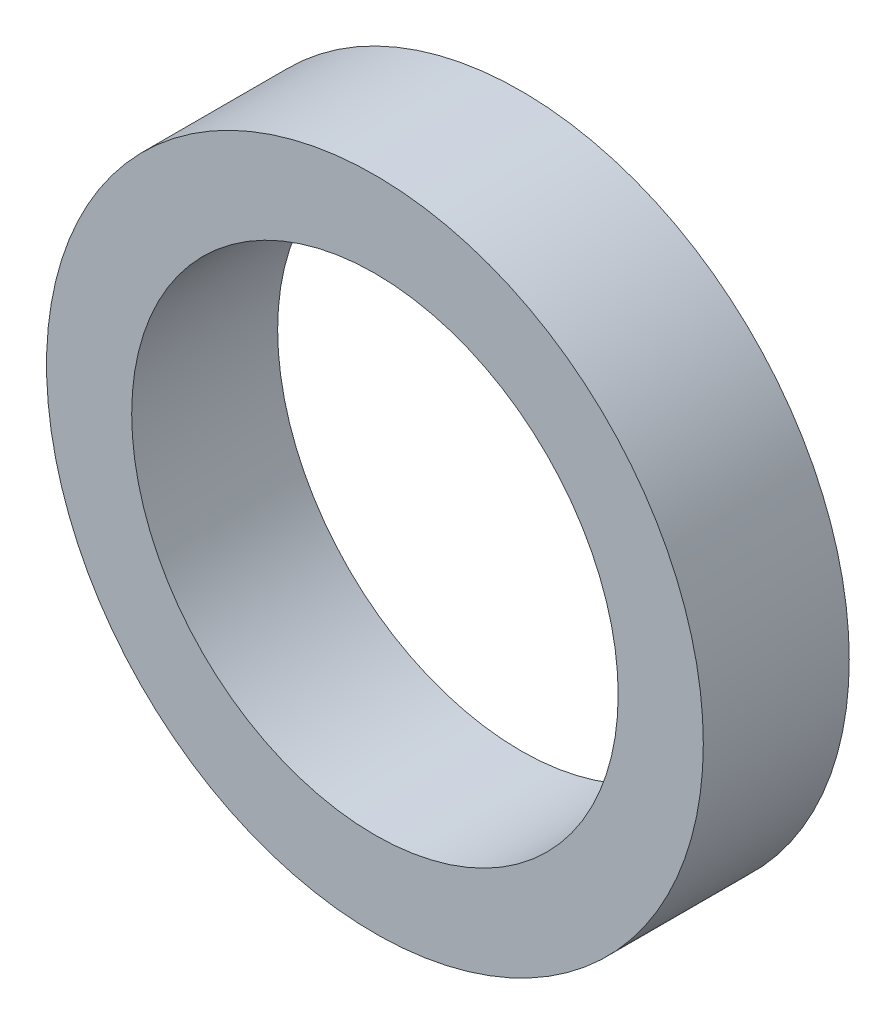
ISO-10303-21;
HEADER;
FILE_DESCRIPTION(('STEP AP214'),'2;1');
FILE_NAME('part.step','',(''),(''),'','','');
FILE_SCHEMA(('AUTOMOTIVE_DESIGN { 1 0 10303 214 1 1 1 1 }'));
ENDSEC;
DATA;
#1=APPLICATION_CONTEXT('core data for automotive mechanical design processes');
#2=APPLICATION_PROTOCOL_DEFINITION('international standard','automotive_design',2000,#1);
#3=PRODUCT_CONTEXT('',#1,'mechanical');
#4=PRODUCT('Part','Part','',(#3));
#5=PRODUCT_RELATED_PRODUCT_CATEGORY('part','',(#4));
#6=PRODUCT_DEFINITION_FORMATION('','',#4);
#7=PRODUCT_DEFINITION_CONTEXT('part definition',#1,'design');
#8=PRODUCT_DEFINITION('design','',#6,#7);
#9=PRODUCT_DEFINITION_SHAPE('','',#8);
#10=(LENGTH_UNIT() NAMED_UNIT(*) SI_UNIT(.MILLI.,.METRE.));
#11=(NAMED_UNIT(*) PLANE_ANGLE_UNIT() SI_UNIT($,.RADIAN.));
#12=(NAMED_UNIT(*) SI_UNIT($,.STERADIAN.) SOLID_ANGLE_UNIT());
#13=UNCERTAINTY_MEASURE_WITH_UNIT(LENGTH_MEASURE(1.E-05),#10,'distance_accuracy_value','');
#14=(GEOMETRIC_REPRESENTATION_CONTEXT(3) GLOBAL_UNCERTAINTY_ASSIGNED_CONTEXT((#13)) GLOBAL_UNIT_ASSIGNED_CONTEXT((#10,
#11,#12)) REPRESENTATION_CONTEXT('',''));
#15=CARTESIAN_POINT('',(0.,0.,0.));
#16=DIRECTION('',(0.,0.,1.));
#17=DIRECTION('',(1.,0.,0.));
#18=AXIS2_PLACEMENT_3D('',#15,#16,#17);
#19=CARTESIAN_POINT('',(0.,0.,6.));
#20=DIRECTION('',(0.,0.,-1.));
#21=DIRECTION('',(-1.,0.,0.));
#22=AXIS2_PLACEMENT_3D('',#19,#20,#21);
#23=CYLINDRICAL_SURFACE('',#22,13.5);
#24=CARTESIAN_POINT('',(0.,0.,6.));
#25=DIRECTION('',(0.,0.,1.));
#26=DIRECTION('',(1.,0.,0.));
#27=AXIS2_PLACEMENT_3D('',#24,#25,#26);
#28=CIRCLE('',#27,13.5);
#29=CARTESIAN_POINT('',(13.5,0.,6.));
#30=VERTEX_POINT('',#29);
#31=EDGE_CURVE('E10',#30,#30,#28,.T.);
#32=ORIENTED_EDGE('',*,*,#31,.F.);
#33=EDGE_LOOP('',(#32));
#34=FACE_BOUND('',#33,.T.);
#35=CARTESIAN_POINT('',(0.,0.,0.));
#36=DIRECTION('',(0.,0.,1.));
#37=DIRECTION('',(1.,0.,0.));
#38=AXIS2_PLACEMENT_3D('',#35,#36,#37);
#39=CIRCLE('',#38,13.5);
#40=CARTESIAN_POINT('',(13.5,0.,0.));
#41=VERTEX_POINT('',#40);
#42=EDGE_CURVE('E34',#41,#41,#39,.T.);
#43=ORIENTED_EDGE('',*,*,#42,.T.);
#44=EDGE_LOOP('',(#43));
#45=FACE_BOUND('',#44,.T.);
#46=ADVANCED_FACE('F31',(#34,#45),#23,.T.);
#47=CARTESIAN_POINT('',(0.,0.,6.));
#48=DIRECTION('',(0.,0.,1.));
#49=DIRECTION('',(1.,0.,0.));
#50=AXIS2_PLACEMENT_3D('',#47,#48,#49);
#51=PLANE('',#50);
#52=CARTESIAN_POINT('',(0.,0.,6.));
#53=DIRECTION('',(0.,0.,-1.));
#54=DIRECTION('',(-1.,0.,0.));
#55=AXIS2_PLACEMENT_3D('',#52,#53,#54);
#56=CIRCLE('',#55,10.);
#57=CARTESIAN_POINT('',(-10.,0.,6.));
#58=VERTEX_POINT('',#57);
#59=EDGE_CURVE('E41',#58,#58,#56,.T.);
#60=ORIENTED_EDGE('',*,*,#59,.T.);
#61=EDGE_LOOP('',(#60));
#62=FACE_BOUND('',#61,.T.);
#63=ORIENTED_EDGE('',*,*,#31,.T.);
#64=EDGE_LOOP('',(#63));
#65=FACE_BOUND('',#64,.T.);
#66=ADVANCED_FACE('F49',(#62,#65),#51,.T.);
#67=CARTESIAN_POINT('',(0.,0.,0.));
#68=DIRECTION('',(0.,0.,1.));
#69=DIRECTION('',(1.,0.,0.));
#70=AXIS2_PLACEMENT_3D('',#67,#68,#69);
#71=PLANE('',#70);
#72=CARTESIAN_POINT('',(0.,0.,0.));
#73=DIRECTION('',(0.,0.,-1.));
#74=DIRECTION('',(-1.,0.,0.));
#75=AXIS2_PLACEMENT_3D('',#72,#73,#74);
#76=CIRCLE('',#75,10.);
#77=CARTESIAN_POINT('',(-10.,0.,0.));
#78=VERTEX_POINT('',#77);
#79=EDGE_CURVE('E43',#78,#78,#76,.T.);
#80=ORIENTED_EDGE('',*,*,#79,.F.);
#81=EDGE_LOOP('',(#80));
#82=FACE_BOUND('',#81,.T.);
#83=ORIENTED_EDGE('',*,*,#42,.F.);
#84=EDGE_LOOP('',(#83));
#85=FACE_BOUND('',#84,.T.);
#86=ADVANCED_FACE('F54',(#82,#85),#71,.F.);
#87=CARTESIAN_POINT('',(0.,0.,6.));
#88=DIRECTION('',(0.,0.,-1.));
#89=DIRECTION('',(-1.,0.,0.));
#90=AXIS2_PLACEMENT_3D('',#87,#88,#89);
#91=CYLINDRICAL_SURFACE('',#90,10.);
#92=ORIENTED_EDGE('',*,*,#59,.F.);
#93=EDGE_LOOP('',(#92));
#94=FACE_BOUND('',#93,.T.);
#95=ORIENTED_EDGE('',*,*,#79,.T.);
#96=EDGE_LOOP('',(#95));
#97=FACE_BOUND('',#96,.T.);
#98=ADVANCED_FACE('F51',(#94,#97),#91,.F.);
#99=CLOSED_SHELL('',(#46,#66,#86,#98));
#100=MANIFOLD_SOLID_BREP('B2',#99);
#101=ADVANCED_BREP_SHAPE_REPRESENTATION('',(#18,#100),#14);
#102=SHAPE_DEFINITION_REPRESENTATION(#9,#101);
ENDSEC;
END-ISO-10303-21;
